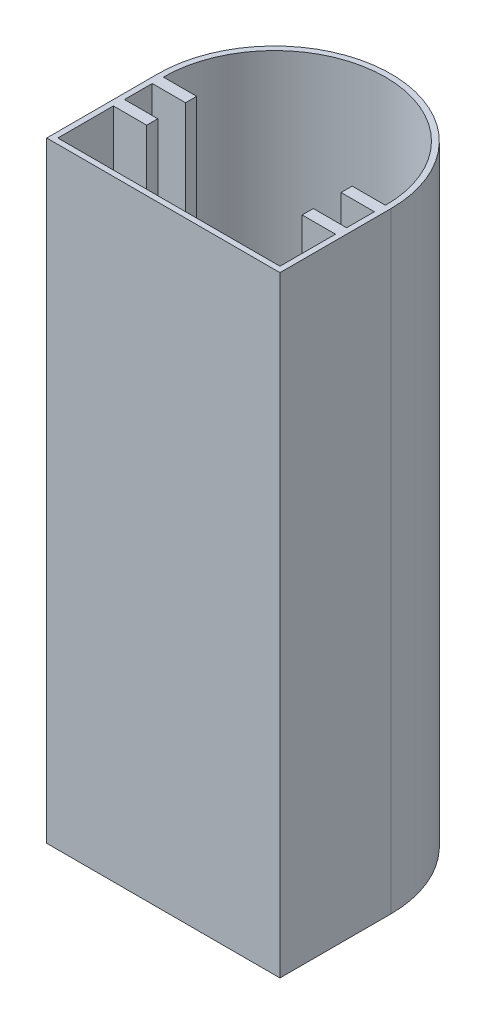
ISO-10303-21;
HEADER;
FILE_DESCRIPTION(('STEP AP214'),'2;1');
FILE_NAME('part.step','',(''),(''),'','','');
FILE_SCHEMA(('AUTOMOTIVE_DESIGN { 1 0 10303 214 1 1 1 1 }'));
ENDSEC;
DATA;
#1=APPLICATION_CONTEXT('core data for automotive mechanical design processes');
#2=APPLICATION_PROTOCOL_DEFINITION('international standard','automotive_design',2000,#1);
#3=PRODUCT_CONTEXT('',#1,'mechanical');
#4=PRODUCT('Part','Part','',(#3));
#5=PRODUCT_RELATED_PRODUCT_CATEGORY('part','',(#4));
#6=PRODUCT_DEFINITION_FORMATION('','',#4);
#7=PRODUCT_DEFINITION_CONTEXT('part definition',#1,'design');
#8=PRODUCT_DEFINITION('design','',#6,#7);
#9=PRODUCT_DEFINITION_SHAPE('','',#8);
#10=(LENGTH_UNIT() NAMED_UNIT(*) SI_UNIT(.MILLI.,.METRE.));
#11=(NAMED_UNIT(*) PLANE_ANGLE_UNIT() SI_UNIT($,.RADIAN.));
#12=(NAMED_UNIT(*) SI_UNIT($,.STERADIAN.) SOLID_ANGLE_UNIT());
#13=UNCERTAINTY_MEASURE_WITH_UNIT(LENGTH_MEASURE(1.E-05),#10,'distance_accuracy_value','');
#14=(GEOMETRIC_REPRESENTATION_CONTEXT(3) GLOBAL_UNCERTAINTY_ASSIGNED_CONTEXT((#13)) GLOBAL_UNIT_ASSIGNED_CONTEXT((#10,
#11,#12)) REPRESENTATION_CONTEXT('',''));
#15=CARTESIAN_POINT('',(0.,0.,0.));
#16=DIRECTION('',(0.,0.,1.));
#17=DIRECTION('',(1.,0.,0.));
#18=AXIS2_PLACEMENT_3D('',#15,#16,#17);
#19=CARTESIAN_POINT('',(-40.8830935251799,110.,1.70773381294964));
#20=DIRECTION('',(0.,0.,-1.));
#21=DIRECTION('',(-1.,0.,0.));
#22=AXIS2_PLACEMENT_3D('',#19,#20,#21);
#23=PLANE('',#22);
#24=DIRECTION('',(1.,0.,0.));
#25=VECTOR('',#24,1.);
#26=CARTESIAN_POINT('',(-40.8830935251799,0.,1.70773381294964));
#27=LINE('',#26,#25);
#28=CARTESIAN_POINT('',(-40.8830935251799,0.,1.70773381294964));
#29=VERTEX_POINT('',#28);
#30=CARTESIAN_POINT('',(1.11690647482014,0.,1.70773381294964));
#31=VERTEX_POINT('',#30);
#32=EDGE_CURVE('E311',#29,#31,#27,.T.);
#33=ORIENTED_EDGE('',*,*,#32,.T.);
#34=DIRECTION('',(0.,-1.,0.));
#35=VECTOR('',#34,1.);
#36=CARTESIAN_POINT('',(1.11690647482014,110.,1.70773381294964));
#37=LINE('',#36,#35);
#38=CARTESIAN_POINT('',(1.11690647482014,110.,1.70773381294964));
#39=VERTEX_POINT('',#38);
#40=EDGE_CURVE('E11',#39,#31,#37,.T.);
#41=ORIENTED_EDGE('',*,*,#40,.F.);
#42=DIRECTION('',(1.,0.,0.));
#43=VECTOR('',#42,1.);
#44=CARTESIAN_POINT('',(-40.8830935251799,110.,1.70773381294964));
#45=LINE('',#44,#43);
#46=CARTESIAN_POINT('',(-40.8830935251799,110.,1.70773381294964));
#47=VERTEX_POINT('',#46);
#48=EDGE_CURVE('E343',#47,#39,#45,.T.);
#49=ORIENTED_EDGE('',*,*,#48,.F.);
#50=DIRECTION('',(0.,-1.,0.));
#51=VECTOR('',#50,1.);
#52=CARTESIAN_POINT('',(-40.8830935251799,110.,1.70773381294964));
#53=LINE('',#52,#51);
#54=EDGE_CURVE('E57',#47,#29,#53,.T.);
#55=ORIENTED_EDGE('',*,*,#54,.T.);
#56=EDGE_LOOP('',(#33,#41,#49,#55));
#57=FACE_BOUND('',#56,.T.);
#58=ADVANCED_FACE('F33',(#57),#23,.F.);
#59=CARTESIAN_POINT('',(1.11690647482014,110.,1.70773381294964));
#60=DIRECTION('',(-1.,0.,0.));
#61=DIRECTION('',(0.,0.,1.));
#62=AXIS2_PLACEMENT_3D('',#59,#60,#61);
#63=PLANE('',#62);
#64=DIRECTION('',(0.,0.,-1.));
#65=VECTOR('',#64,1.);
#66=CARTESIAN_POINT('',(1.11690647482014,0.,1.70773381294964));
#67=LINE('',#66,#65);
#68=CARTESIAN_POINT('',(1.11690647482014,0.,-18.2922661870504));
#69=VERTEX_POINT('',#68);
#70=EDGE_CURVE('E352',#31,#69,#67,.T.);
#71=ORIENTED_EDGE('',*,*,#70,.T.);
#72=DIRECTION('',(0.,-1.,0.));
#73=VECTOR('',#72,1.);
#74=CARTESIAN_POINT('',(1.11690647482014,110.,-18.2922661870504));
#75=LINE('',#74,#73);
#76=CARTESIAN_POINT('',(1.11690647482014,110.,-18.2922661870504));
#77=VERTEX_POINT('',#76);
#78=EDGE_CURVE('E41',#77,#69,#75,.T.);
#79=ORIENTED_EDGE('',*,*,#78,.F.);
#80=DIRECTION('',(0.,0.,-1.));
#81=VECTOR('',#80,1.);
#82=CARTESIAN_POINT('',(1.11690647482014,110.,1.70773381294964));
#83=LINE('',#82,#81);
#84=EDGE_CURVE('E83',#39,#77,#83,.T.);
#85=ORIENTED_EDGE('',*,*,#84,.F.);
#86=ORIENTED_EDGE('',*,*,#40,.T.);
#87=EDGE_LOOP('',(#71,#79,#85,#86));
#88=FACE_BOUND('',#87,.T.);
#89=ADVANCED_FACE('F375',(#88),#63,.F.);
#90=CARTESIAN_POINT('',(-19.8830935251799,110.,-18.2922661870504));
#91=DIRECTION('',(0.,-1.,0.));
#92=DIRECTION('',(0.,0.,-1.));
#93=AXIS2_PLACEMENT_3D('',#90,#91,#92);
#94=CYLINDRICAL_SURFACE('',#93,21.);
#95=CARTESIAN_POINT('',(-19.8830935251799,0.,-18.2922661870504));
#96=DIRECTION('',(0.,1.,0.));
#97=DIRECTION('',(0.,0.,1.));
#98=AXIS2_PLACEMENT_3D('',#95,#96,#97);
#99=CIRCLE('',#98,21.);
#100=CARTESIAN_POINT('',(-40.8830935251799,0.,-18.2922661870504));
#101=VERTEX_POINT('',#100);
#102=EDGE_CURVE('E354',#69,#101,#99,.T.);
#103=ORIENTED_EDGE('',*,*,#102,.T.);
#104=DIRECTION('',(0.,-1.,0.));
#105=VECTOR('',#104,1.);
#106=CARTESIAN_POINT('',(-40.8830935251799,110.,-18.2922661870504));
#107=LINE('',#106,#105);
#108=CARTESIAN_POINT('',(-40.8830935251799,110.,-18.2922661870504));
#109=VERTEX_POINT('',#108);
#110=EDGE_CURVE('E360',#109,#101,#107,.T.);
#111=ORIENTED_EDGE('',*,*,#110,.F.);
#112=CARTESIAN_POINT('',(-19.8830935251799,110.,-18.2922661870504));
#113=DIRECTION('',(0.,1.,0.));
#114=DIRECTION('',(0.,0.,1.));
#115=AXIS2_PLACEMENT_3D('',#112,#113,#114);
#116=CIRCLE('',#115,21.);
#117=EDGE_CURVE('E347',#77,#109,#116,.T.);
#118=ORIENTED_EDGE('',*,*,#117,.F.);
#119=ORIENTED_EDGE('',*,*,#78,.T.);
#120=EDGE_LOOP('',(#103,#111,#118,#119));
#121=FACE_BOUND('',#120,.T.);
#122=ADVANCED_FACE('F366',(#121),#94,.T.);
#123=CARTESIAN_POINT('',(-40.8830935251799,110.,1.70773381294964));
#124=DIRECTION('',(-1.,0.,0.));
#125=DIRECTION('',(0.,0.,1.));
#126=AXIS2_PLACEMENT_3D('',#123,#124,#125);
#127=PLANE('',#126);
#128=CARTESIAN_POINT('',(-40.8830935251799,55.,-4.95893285371703));
#129=DIRECTION('',(-1.,0.,0.));
#130=DIRECTION('',(0.,0.,1.));
#131=AXIS2_PLACEMENT_3D('',#128,#129,#130);
#132=CIRCLE('',#131,3.375);
#133=CARTESIAN_POINT('',(-40.8830935251799,55.,-1.58393285371703));
#134=VERTEX_POINT('',#133);
#135=EDGE_CURVE('E217',#134,#134,#132,.T.);
#136=ORIENTED_EDGE('',*,*,#135,.F.);
#137=EDGE_LOOP('',(#136));
#138=FACE_BOUND('',#137,.T.);
#139=DIRECTION('',(0.,0.,-1.));
#140=VECTOR('',#139,1.);
#141=CARTESIAN_POINT('',(-40.8830935251799,0.,1.70773381294964));
#142=LINE('',#141,#140);
#143=EDGE_CURVE('E345',#29,#101,#142,.T.);
#144=ORIENTED_EDGE('',*,*,#143,.F.);
#145=ORIENTED_EDGE('',*,*,#54,.F.);
#146=DIRECTION('',(0.,0.,-1.));
#147=VECTOR('',#146,1.);
#148=CARTESIAN_POINT('',(-40.8830935251799,110.,1.70773381294964));
#149=LINE('',#148,#147);
#150=EDGE_CURVE('E349',#47,#109,#149,.T.);
#151=ORIENTED_EDGE('',*,*,#150,.T.);
#152=ORIENTED_EDGE('',*,*,#110,.T.);
#153=EDGE_LOOP('',(#144,#145,#151,#152));
#154=FACE_BOUND('',#153,.T.);
#155=ADVANCED_FACE('F370',(#138,#154),#127,.T.);
#156=CARTESIAN_POINT('',(-19.8830935251799,110.,-18.2922661870504));
#157=DIRECTION('',(0.,1.,0.));
#158=DIRECTION('',(0.,0.,1.));
#159=AXIS2_PLACEMENT_3D('',#156,#157,#158);
#160=PLANE('',#159);
#161=CARTESIAN_POINT('',(-19.8830935251799,110.,-18.2922661870504));
#162=DIRECTION('',(0.,1.,0.));
#163=DIRECTION('',(0.,0.,1.));
#164=AXIS2_PLACEMENT_3D('',#161,#162,#163);
#165=CIRCLE('',#164,20.);
#166=CARTESIAN_POINT('',(0.116906474820141,110.,-18.2922661870504));
#167=VERTEX_POINT('',#166);
#168=CARTESIAN_POINT('',(-39.8830935251799,110.,-18.2922661870504));
#169=VERTEX_POINT('',#168);
#170=EDGE_CURVE('E48',#167,#169,#165,.T.);
#171=ORIENTED_EDGE('',*,*,#170,.F.);
#172=DIRECTION('',(1.,0.,0.));
#173=VECTOR('',#172,1.);
#174=CARTESIAN_POINT('',(0.116906474820141,110.,-18.2922661870504));
#175=LINE('',#174,#173);
#176=CARTESIAN_POINT('',(-5.88309352517986,110.,-18.2922661870504));
#177=VERTEX_POINT('',#176);
#178=EDGE_CURVE('E211',#177,#167,#175,.T.);
#179=ORIENTED_EDGE('',*,*,#178,.F.);
#180=DIRECTION('',(0.,0.,-1.));
#181=VECTOR('',#180,1.);
#182=CARTESIAN_POINT('',(-5.88309352517986,110.,-18.2922661870504));
#183=LINE('',#182,#181);
#184=CARTESIAN_POINT('',(-5.88309352517985,110.,-16.2922661870504));
#185=VERTEX_POINT('',#184);
#186=EDGE_CURVE('E214',#185,#177,#183,.T.);
#187=ORIENTED_EDGE('',*,*,#186,.F.);
#188=DIRECTION('',(-1.,0.,0.));
#189=VECTOR('',#188,1.);
#190=CARTESIAN_POINT('',(-5.88309352517985,110.,-16.2922661870504));
#191=LINE('',#190,#189);
#192=CARTESIAN_POINT('',(0.116906474820142,110.,-16.2922661870504));
#193=VERTEX_POINT('',#192);
#194=EDGE_CURVE('E304',#193,#185,#191,.T.);
#195=ORIENTED_EDGE('',*,*,#194,.F.);
#196=DIRECTION('',(0.,0.,-1.));
#197=VECTOR('',#196,1.);
#198=CARTESIAN_POINT('',(0.116906474820142,110.,-16.2922661870504));
#199=LINE('',#198,#197);
#200=CARTESIAN_POINT('',(0.116906474820143,110.,-11.2922661870504));
#201=VERTEX_POINT('',#200);
#202=EDGE_CURVE('E301',#201,#193,#199,.T.);
#203=ORIENTED_EDGE('',*,*,#202,.F.);
#204=DIRECTION('',(1.,0.,0.));
#205=VECTOR('',#204,1.);
#206=CARTESIAN_POINT('',(0.116906474820143,110.,-11.2922661870504));
#207=LINE('',#206,#205);
#208=CARTESIAN_POINT('',(-5.88309352517986,110.,-11.2922661870504));
#209=VERTEX_POINT('',#208);
#210=EDGE_CURVE('E298',#209,#201,#207,.T.);
#211=ORIENTED_EDGE('',*,*,#210,.F.);
#212=DIRECTION('',(0.,0.,-1.));
#213=VECTOR('',#212,1.);
#214=CARTESIAN_POINT('',(-5.88309352517986,110.,-11.2922661870504));
#215=LINE('',#214,#213);
#216=CARTESIAN_POINT('',(-5.88309352517986,110.,-9.29226618705036));
#217=VERTEX_POINT('',#216);
#218=EDGE_CURVE('E295',#217,#209,#215,.T.);
#219=ORIENTED_EDGE('',*,*,#218,.F.);
#220=DIRECTION('',(-1.,0.,0.));
#221=VECTOR('',#220,1.);
#222=CARTESIAN_POINT('',(-5.88309352517986,110.,-9.29226618705036));
#223=LINE('',#222,#221);
#224=CARTESIAN_POINT('',(0.116906474820143,110.,-9.29226618705036));
#225=VERTEX_POINT('',#224);
#226=EDGE_CURVE('E292',#225,#217,#223,.T.);
#227=ORIENTED_EDGE('',*,*,#226,.F.);
#228=DIRECTION('',(0.,0.,-1.));
#229=VECTOR('',#228,1.);
#230=CARTESIAN_POINT('',(0.116906474820143,110.,-9.29226618705036));
#231=LINE('',#230,#229);
#232=CARTESIAN_POINT('',(0.116906474820145,110.,0.70773381294964));
#233=VERTEX_POINT('',#232);
#234=EDGE_CURVE('E289',#233,#225,#231,.T.);
#235=ORIENTED_EDGE('',*,*,#234,.F.);
#236=DIRECTION('',(1.,0.,0.));
#237=VECTOR('',#236,1.);
#238=CARTESIAN_POINT('',(-39.8830935251799,110.,0.707733812949641));
#239=LINE('',#238,#237);
#240=CARTESIAN_POINT('',(-39.8830935251799,110.,0.707733812949641));
#241=VERTEX_POINT('',#240);
#242=EDGE_CURVE('E286',#241,#233,#239,.T.);
#243=ORIENTED_EDGE('',*,*,#242,.F.);
#244=DIRECTION('',(0.,0.,1.));
#245=VECTOR('',#244,1.);
#246=CARTESIAN_POINT('',(-39.8830935251798,110.,-9.29226618705036));
#247=LINE('',#246,#245);
#248=CARTESIAN_POINT('',(-39.8830935251798,110.,-9.29226618705036));
#249=VERTEX_POINT('',#248);
#250=EDGE_CURVE('E283',#249,#241,#247,.T.);
#251=ORIENTED_EDGE('',*,*,#250,.F.);
#252=DIRECTION('',(-1.,0.,0.));
#253=VECTOR('',#252,1.);
#254=CARTESIAN_POINT('',(-33.8830935251798,110.,-9.29226618705036));
#255=LINE('',#254,#253);
#256=CARTESIAN_POINT('',(-33.8830935251798,110.,-9.29226618705036));
#257=VERTEX_POINT('',#256);
#258=EDGE_CURVE('E280',#257,#249,#255,.T.);
#259=ORIENTED_EDGE('',*,*,#258,.F.);
#260=DIRECTION('',(0.,0.,1.));
#261=VECTOR('',#260,1.);
#262=CARTESIAN_POINT('',(-33.8830935251798,110.,-11.2922661870504));
#263=LINE('',#262,#261);
#264=CARTESIAN_POINT('',(-33.8830935251798,110.,-11.2922661870504));
#265=VERTEX_POINT('',#264);
#266=EDGE_CURVE('E277',#265,#257,#263,.T.);
#267=ORIENTED_EDGE('',*,*,#266,.F.);
#268=DIRECTION('',(1.,0.,0.));
#269=VECTOR('',#268,1.);
#270=CARTESIAN_POINT('',(-39.8830935251798,110.,-11.2922661870504));
#271=LINE('',#270,#269);
#272=CARTESIAN_POINT('',(-39.8830935251798,110.,-11.2922661870504));
#273=VERTEX_POINT('',#272);
#274=EDGE_CURVE('E274',#273,#265,#271,.T.);
#275=ORIENTED_EDGE('',*,*,#274,.F.);
#276=DIRECTION('',(0.,0.,1.));
#277=VECTOR('',#276,1.);
#278=CARTESIAN_POINT('',(-39.8830935251798,110.,-16.2922661870504));
#279=LINE('',#278,#277);
#280=CARTESIAN_POINT('',(-39.8830935251798,110.,-16.2922661870504));
#281=VERTEX_POINT('',#280);
#282=EDGE_CURVE('E271',#281,#273,#279,.T.);
#283=ORIENTED_EDGE('',*,*,#282,.F.);
#284=DIRECTION('',(-1.,0.,0.));
#285=VECTOR('',#284,1.);
#286=CARTESIAN_POINT('',(-33.8830935251799,110.,-16.2922661870504));
#287=LINE('',#286,#285);
#288=CARTESIAN_POINT('',(-33.8830935251799,110.,-16.2922661870504));
#289=VERTEX_POINT('',#288);
#290=EDGE_CURVE('E268',#289,#281,#287,.T.);
#291=ORIENTED_EDGE('',*,*,#290,.F.);
#292=DIRECTION('',(0.,0.,1.));
#293=VECTOR('',#292,1.);
#294=CARTESIAN_POINT('',(-33.8830935251799,110.,-18.2922661870504));
#295=LINE('',#294,#293);
#296=CARTESIAN_POINT('',(-33.8830935251799,110.,-18.2922661870504));
#297=VERTEX_POINT('',#296);
#298=EDGE_CURVE('E265',#297,#289,#295,.T.);
#299=ORIENTED_EDGE('',*,*,#298,.F.);
#300=DIRECTION('',(1.,0.,0.));
#301=VECTOR('',#300,1.);
#302=CARTESIAN_POINT('',(-39.8830935251799,110.,-18.2922661870504));
#303=LINE('',#302,#301);
#304=EDGE_CURVE('E263',#169,#297,#303,.T.);
#305=ORIENTED_EDGE('',*,*,#304,.F.);
#306=EDGE_LOOP('',(#171,#179,#187,#195,#203,#211,#219,#227,#235,#243,#251,#259,#267,#275,#283,
#291,#299,#305));
#307=FACE_BOUND('',#306,.T.);
#308=ORIENTED_EDGE('',*,*,#48,.T.);
#309=ORIENTED_EDGE('',*,*,#84,.T.);
#310=ORIENTED_EDGE('',*,*,#117,.T.);
#311=ORIENTED_EDGE('',*,*,#150,.F.);
#312=EDGE_LOOP('',(#308,#309,#310,#311));
#313=FACE_BOUND('',#312,.T.);
#314=ADVANCED_FACE('F373',(#307,#313),#160,.T.);
#315=CARTESIAN_POINT('',(-19.8830935251799,0.,-18.2922661870504));
#316=DIRECTION('',(0.,1.,0.));
#317=DIRECTION('',(0.,0.,1.));
#318=AXIS2_PLACEMENT_3D('',#315,#316,#317);
#319=PLANE('',#318);
#320=ORIENTED_EDGE('',*,*,#32,.F.);
#321=ORIENTED_EDGE('',*,*,#143,.T.);
#322=ORIENTED_EDGE('',*,*,#102,.F.);
#323=ORIENTED_EDGE('',*,*,#70,.F.);
#324=EDGE_LOOP('',(#320,#321,#322,#323));
#325=FACE_BOUND('',#324,.T.);
#326=ADVANCED_FACE('F369',(#325),#319,.F.);
#327=CARTESIAN_POINT('',(-19.8830935251799,1.,-18.2922661870504));
#328=DIRECTION('',(0.,1.,0.));
#329=DIRECTION('',(0.,0.,1.));
#330=AXIS2_PLACEMENT_3D('',#327,#328,#329);
#331=CYLINDRICAL_SURFACE('',#330,20.);
#332=ORIENTED_EDGE('',*,*,#170,.T.);
#333=DIRECTION('',(0.,1.,0.));
#334=VECTOR('',#333,1.);
#335=CARTESIAN_POINT('',(-39.8830935251799,1.,-18.2922661870504));
#336=LINE('',#335,#334);
#337=CARTESIAN_POINT('',(-39.8830935251799,1.,-18.2922661870504));
#338=VERTEX_POINT('',#337);
#339=EDGE_CURVE('E188',#338,#169,#336,.T.);
#340=ORIENTED_EDGE('',*,*,#339,.F.);
#341=CARTESIAN_POINT('',(-19.8830935251799,1.,-18.2922661870504));
#342=DIRECTION('',(0.,1.,0.));
#343=DIRECTION('',(0.,0.,1.));
#344=AXIS2_PLACEMENT_3D('',#341,#342,#343);
#345=CIRCLE('',#344,20.);
#346=CARTESIAN_POINT('',(0.116906474820141,1.,-18.2922661870504));
#347=VERTEX_POINT('',#346);
#348=EDGE_CURVE('E192',#347,#338,#345,.T.);
#349=ORIENTED_EDGE('',*,*,#348,.F.);
#350=DIRECTION('',(0.,1.,0.));
#351=VECTOR('',#350,1.);
#352=CARTESIAN_POINT('',(0.116906474820141,1.,-18.2922661870504));
#353=LINE('',#352,#351);
#354=EDGE_CURVE('E309',#347,#167,#353,.T.);
#355=ORIENTED_EDGE('',*,*,#354,.T.);
#356=EDGE_LOOP('',(#332,#340,#349,#355));
#357=FACE_BOUND('',#356,.T.);
#358=ADVANCED_FACE('F190',(#357),#331,.F.);
#359=CARTESIAN_POINT('',(0.116906474820141,1.,-18.2922661870504));
#360=DIRECTION('',(0.,0.,1.));
#361=DIRECTION('',(1.,0.,0.));
#362=AXIS2_PLACEMENT_3D('',#359,#360,#361);
#363=PLANE('',#362);
#364=ORIENTED_EDGE('',*,*,#178,.T.);
#365=ORIENTED_EDGE('',*,*,#354,.F.);
#366=DIRECTION('',(1.,0.,0.));
#367=VECTOR('',#366,1.);
#368=CARTESIAN_POINT('',(0.116906474820141,1.,-18.2922661870504));
#369=LINE('',#368,#367);
#370=CARTESIAN_POINT('',(-5.88309352517986,1.,-18.2922661870504));
#371=VERTEX_POINT('',#370);
#372=EDGE_CURVE('E198',#371,#347,#369,.T.);
#373=ORIENTED_EDGE('',*,*,#372,.F.);
#374=DIRECTION('',(0.,1.,0.));
#375=VECTOR('',#374,1.);
#376=CARTESIAN_POINT('',(-5.88309352517986,1.,-18.2922661870504));
#377=LINE('',#376,#375);
#378=EDGE_CURVE('E312',#371,#177,#377,.T.);
#379=ORIENTED_EDGE('',*,*,#378,.T.);
#380=EDGE_LOOP('',(#364,#365,#373,#379));
#381=FACE_BOUND('',#380,.T.);
#382=ADVANCED_FACE('F393',(#381),#363,.F.);
#383=CARTESIAN_POINT('',(-5.88309352517986,1.,-18.2922661870504));
#384=DIRECTION('',(1.,0.,0.));
#385=DIRECTION('',(0.,0.,-1.));
#386=AXIS2_PLACEMENT_3D('',#383,#384,#385);
#387=PLANE('',#386);
#388=ORIENTED_EDGE('',*,*,#186,.T.);
#389=ORIENTED_EDGE('',*,*,#378,.F.);
#390=DIRECTION('',(0.,0.,-1.));
#391=VECTOR('',#390,1.);
#392=CARTESIAN_POINT('',(-5.88309352517986,1.,-18.2922661870504));
#393=LINE('',#392,#391);
#394=CARTESIAN_POINT('',(-5.88309352517985,1.,-16.2922661870504));
#395=VERTEX_POINT('',#394);
#396=EDGE_CURVE('E259',#395,#371,#393,.T.);
#397=ORIENTED_EDGE('',*,*,#396,.F.);
#398=DIRECTION('',(0.,1.,0.));
#399=VECTOR('',#398,1.);
#400=CARTESIAN_POINT('',(-5.88309352517985,1.,-16.2922661870504));
#401=LINE('',#400,#399);
#402=EDGE_CURVE('E314',#395,#185,#401,.T.);
#403=ORIENTED_EDGE('',*,*,#402,.T.);
#404=EDGE_LOOP('',(#388,#389,#397,#403));
#405=FACE_BOUND('',#404,.T.);
#406=ADVANCED_FACE('F451',(#405),#387,.F.);
#407=CARTESIAN_POINT('',(-5.88309352517985,1.,-16.2922661870504));
#408=DIRECTION('',(0.,0.,-1.));
#409=DIRECTION('',(-1.,0.,0.));
#410=AXIS2_PLACEMENT_3D('',#407,#408,#409);
#411=PLANE('',#410);
#412=ORIENTED_EDGE('',*,*,#194,.T.);
#413=ORIENTED_EDGE('',*,*,#402,.F.);
#414=DIRECTION('',(-1.,0.,0.));
#415=VECTOR('',#414,1.);
#416=CARTESIAN_POINT('',(-5.88309352517985,1.,-16.2922661870504));
#417=LINE('',#416,#415);
#418=CARTESIAN_POINT('',(0.116906474820142,1.,-16.2922661870504));
#419=VERTEX_POINT('',#418);
#420=EDGE_CURVE('E256',#419,#395,#417,.T.);
#421=ORIENTED_EDGE('',*,*,#420,.F.);
#422=DIRECTION('',(0.,1.,0.));
#423=VECTOR('',#422,1.);
#424=CARTESIAN_POINT('',(0.116906474820142,1.,-16.2922661870504));
#425=LINE('',#424,#423);
#426=EDGE_CURVE('E316',#419,#193,#425,.T.);
#427=ORIENTED_EDGE('',*,*,#426,.T.);
#428=EDGE_LOOP('',(#412,#413,#421,#427));
#429=FACE_BOUND('',#428,.T.);
#430=ADVANCED_FACE('F447',(#429),#411,.F.);
#431=CARTESIAN_POINT('',(0.116906474820142,1.,-16.2922661870504));
#432=DIRECTION('',(1.,0.,0.));
#433=DIRECTION('',(0.,0.,-1.));
#434=AXIS2_PLACEMENT_3D('',#431,#432,#433);
#435=PLANE('',#434);
#436=ORIENTED_EDGE('',*,*,#202,.T.);
#437=ORIENTED_EDGE('',*,*,#426,.F.);
#438=DIRECTION('',(0.,0.,-1.));
#439=VECTOR('',#438,1.);
#440=CARTESIAN_POINT('',(0.116906474820142,1.,-16.2922661870504));
#441=LINE('',#440,#439);
#442=CARTESIAN_POINT('',(0.116906474820143,1.,-11.2922661870504));
#443=VERTEX_POINT('',#442);
#444=EDGE_CURVE('E253',#443,#419,#441,.T.);
#445=ORIENTED_EDGE('',*,*,#444,.F.);
#446=DIRECTION('',(0.,1.,0.));
#447=VECTOR('',#446,1.);
#448=CARTESIAN_POINT('',(0.116906474820143,1.,-11.2922661870504));
#449=LINE('',#448,#447);
#450=EDGE_CURVE('E318',#443,#201,#449,.T.);
#451=ORIENTED_EDGE('',*,*,#450,.T.);
#452=EDGE_LOOP('',(#436,#437,#445,#451));
#453=FACE_BOUND('',#452,.T.);
#454=ADVANCED_FACE('F443',(#453),#435,.F.);
#455=CARTESIAN_POINT('',(0.116906474820143,1.,-11.2922661870504));
#456=DIRECTION('',(0.,0.,1.));
#457=DIRECTION('',(1.,0.,0.));
#458=AXIS2_PLACEMENT_3D('',#455,#456,#457);
#459=PLANE('',#458);
#460=ORIENTED_EDGE('',*,*,#210,.T.);
#461=ORIENTED_EDGE('',*,*,#450,.F.);
#462=DIRECTION('',(1.,0.,0.));
#463=VECTOR('',#462,1.);
#464=CARTESIAN_POINT('',(0.116906474820143,1.,-11.2922661870504));
#465=LINE('',#464,#463);
#466=CARTESIAN_POINT('',(-5.88309352517986,1.,-11.2922661870504));
#467=VERTEX_POINT('',#466);
#468=EDGE_CURVE('E250',#467,#443,#465,.T.);
#469=ORIENTED_EDGE('',*,*,#468,.F.);
#470=DIRECTION('',(0.,1.,0.));
#471=VECTOR('',#470,1.);
#472=CARTESIAN_POINT('',(-5.88309352517986,1.,-11.2922661870504));
#473=LINE('',#472,#471);
#474=EDGE_CURVE('E320',#467,#209,#473,.T.);
#475=ORIENTED_EDGE('',*,*,#474,.T.);
#476=EDGE_LOOP('',(#460,#461,#469,#475));
#477=FACE_BOUND('',#476,.T.);
#478=ADVANCED_FACE('F439',(#477),#459,.F.);
#479=CARTESIAN_POINT('',(-5.88309352517986,1.,-11.2922661870504));
#480=DIRECTION('',(1.,0.,0.));
#481=DIRECTION('',(0.,0.,-1.));
#482=AXIS2_PLACEMENT_3D('',#479,#480,#481);
#483=PLANE('',#482);
#484=ORIENTED_EDGE('',*,*,#218,.T.);
#485=ORIENTED_EDGE('',*,*,#474,.F.);
#486=DIRECTION('',(0.,0.,-1.));
#487=VECTOR('',#486,1.);
#488=CARTESIAN_POINT('',(-5.88309352517986,1.,-11.2922661870504));
#489=LINE('',#488,#487);
#490=CARTESIAN_POINT('',(-5.88309352517986,1.,-9.29226618705036));
#491=VERTEX_POINT('',#490);
#492=EDGE_CURVE('E247',#491,#467,#489,.T.);
#493=ORIENTED_EDGE('',*,*,#492,.F.);
#494=DIRECTION('',(0.,1.,0.));
#495=VECTOR('',#494,1.);
#496=CARTESIAN_POINT('',(-5.88309352517986,1.,-9.29226618705036));
#497=LINE('',#496,#495);
#498=EDGE_CURVE('E322',#491,#217,#497,.T.);
#499=ORIENTED_EDGE('',*,*,#498,.T.);
#500=EDGE_LOOP('',(#484,#485,#493,#499));
#501=FACE_BOUND('',#500,.T.);
#502=ADVANCED_FACE('F435',(#501),#483,.F.);
#503=CARTESIAN_POINT('',(-5.88309352517986,1.,-9.29226618705036));
#504=DIRECTION('',(0.,0.,-1.));
#505=DIRECTION('',(-1.,0.,0.));
#506=AXIS2_PLACEMENT_3D('',#503,#504,#505);
#507=PLANE('',#506);
#508=ORIENTED_EDGE('',*,*,#226,.T.);
#509=ORIENTED_EDGE('',*,*,#498,.F.);
#510=DIRECTION('',(-1.,0.,0.));
#511=VECTOR('',#510,1.);
#512=CARTESIAN_POINT('',(-5.88309352517986,1.,-9.29226618705036));
#513=LINE('',#512,#511);
#514=CARTESIAN_POINT('',(0.116906474820143,1.,-9.29226618705036));
#515=VERTEX_POINT('',#514);
#516=EDGE_CURVE('E244',#515,#491,#513,.T.);
#517=ORIENTED_EDGE('',*,*,#516,.F.);
#518=DIRECTION('',(0.,1.,0.));
#519=VECTOR('',#518,1.);
#520=CARTESIAN_POINT('',(0.116906474820143,1.,-9.29226618705036));
#521=LINE('',#520,#519);
#522=EDGE_CURVE('E324',#515,#225,#521,.T.);
#523=ORIENTED_EDGE('',*,*,#522,.T.);
#524=EDGE_LOOP('',(#508,#509,#517,#523));
#525=FACE_BOUND('',#524,.T.);
#526=ADVANCED_FACE('F431',(#525),#507,.F.);
#527=CARTESIAN_POINT('',(0.116906474820143,1.,-9.29226618705036));
#528=DIRECTION('',(1.,0.,0.));
#529=DIRECTION('',(0.,0.,-1.));
#530=AXIS2_PLACEMENT_3D('',#527,#528,#529);
#531=PLANE('',#530);
#532=ORIENTED_EDGE('',*,*,#234,.T.);
#533=ORIENTED_EDGE('',*,*,#522,.F.);
#534=DIRECTION('',(0.,0.,-1.));
#535=VECTOR('',#534,1.);
#536=CARTESIAN_POINT('',(0.116906474820143,1.,-9.29226618705036));
#537=LINE('',#536,#535);
#538=CARTESIAN_POINT('',(0.116906474820145,1.,0.70773381294964));
#539=VERTEX_POINT('',#538);
#540=EDGE_CURVE('E241',#539,#515,#537,.T.);
#541=ORIENTED_EDGE('',*,*,#540,.F.);
#542=DIRECTION('',(0.,1.,0.));
#543=VECTOR('',#542,1.);
#544=CARTESIAN_POINT('',(0.116906474820145,1.,0.70773381294964));
#545=LINE('',#544,#543);
#546=EDGE_CURVE('E326',#539,#233,#545,.T.);
#547=ORIENTED_EDGE('',*,*,#546,.T.);
#548=EDGE_LOOP('',(#532,#533,#541,#547));
#549=FACE_BOUND('',#548,.T.);
#550=ADVANCED_FACE('F427',(#549),#531,.F.);
#551=CARTESIAN_POINT('',(-39.8830935251799,1.,0.707733812949641));
#552=DIRECTION('',(0.,0.,1.));
#553=DIRECTION('',(1.,0.,0.));
#554=AXIS2_PLACEMENT_3D('',#551,#552,#553);
#555=PLANE('',#554);
#556=ORIENTED_EDGE('',*,*,#242,.T.);
#557=ORIENTED_EDGE('',*,*,#546,.F.);
#558=DIRECTION('',(1.,0.,0.));
#559=VECTOR('',#558,1.);
#560=CARTESIAN_POINT('',(-39.8830935251799,1.,0.707733812949641));
#561=LINE('',#560,#559);
#562=CARTESIAN_POINT('',(-39.8830935251799,1.,0.707733812949641));
#563=VERTEX_POINT('',#562);
#564=EDGE_CURVE('E238',#563,#539,#561,.T.);
#565=ORIENTED_EDGE('',*,*,#564,.F.);
#566=DIRECTION('',(0.,1.,0.));
#567=VECTOR('',#566,1.);
#568=CARTESIAN_POINT('',(-39.8830935251799,1.,0.707733812949641));
#569=LINE('',#568,#567);
#570=EDGE_CURVE('E328',#563,#241,#569,.T.);
#571=ORIENTED_EDGE('',*,*,#570,.T.);
#572=EDGE_LOOP('',(#556,#557,#565,#571));
#573=FACE_BOUND('',#572,.T.);
#574=ADVANCED_FACE('F423',(#573),#555,.F.);
#575=CARTESIAN_POINT('',(-39.8830935251798,1.,-9.29226618705036));
#576=DIRECTION('',(-1.,0.,0.));
#577=DIRECTION('',(0.,0.,1.));
#578=AXIS2_PLACEMENT_3D('',#575,#576,#577);
#579=PLANE('',#578);
#580=CARTESIAN_POINT('',(-39.8830935251799,55.,-4.95893285371703));
#581=DIRECTION('',(-1.,0.,0.));
#582=DIRECTION('',(0.,0.,1.));
#583=AXIS2_PLACEMENT_3D('',#580,#581,#582);
#584=CIRCLE('',#583,3.375);
#585=CARTESIAN_POINT('',(-39.8830935251799,55.,-1.58393285371703));
#586=VERTEX_POINT('',#585);
#587=EDGE_CURVE('E36',#586,#586,#584,.T.);
#588=ORIENTED_EDGE('',*,*,#587,.T.);
#589=EDGE_LOOP('',(#588));
#590=FACE_BOUND('',#589,.T.);
#591=ORIENTED_EDGE('',*,*,#250,.T.);
#592=ORIENTED_EDGE('',*,*,#570,.F.);
#593=DIRECTION('',(0.,0.,1.));
#594=VECTOR('',#593,1.);
#595=CARTESIAN_POINT('',(-39.8830935251798,1.,-9.29226618705036));
#596=LINE('',#595,#594);
#597=CARTESIAN_POINT('',(-39.8830935251798,1.,-9.29226618705036));
#598=VERTEX_POINT('',#597);
#599=EDGE_CURVE('E235',#598,#563,#596,.T.);
#600=ORIENTED_EDGE('',*,*,#599,.F.);
#601=DIRECTION('',(0.,1.,0.));
#602=VECTOR('',#601,1.);
#603=CARTESIAN_POINT('',(-39.8830935251798,1.,-9.29226618705036));
#604=LINE('',#603,#602);
#605=EDGE_CURVE('E330',#598,#249,#604,.T.);
#606=ORIENTED_EDGE('',*,*,#605,.T.);
#607=EDGE_LOOP('',(#591,#592,#600,#606));
#608=FACE_BOUND('',#607,.T.);
#609=ADVANCED_FACE('F419',(#590,#608),#579,.F.);
#610=CARTESIAN_POINT('',(-33.8830935251798,1.,-9.29226618705036));
#611=DIRECTION('',(0.,0.,-1.));
#612=DIRECTION('',(-1.,0.,0.));
#613=AXIS2_PLACEMENT_3D('',#610,#611,#612);
#614=PLANE('',#613);
#615=ORIENTED_EDGE('',*,*,#258,.T.);
#616=ORIENTED_EDGE('',*,*,#605,.F.);
#617=DIRECTION('',(-1.,0.,0.));
#618=VECTOR('',#617,1.);
#619=CARTESIAN_POINT('',(-33.8830935251798,1.,-9.29226618705036));
#620=LINE('',#619,#618);
#621=CARTESIAN_POINT('',(-33.8830935251798,1.,-9.29226618705036));
#622=VERTEX_POINT('',#621);
#623=EDGE_CURVE('E232',#622,#598,#620,.T.);
#624=ORIENTED_EDGE('',*,*,#623,.F.);
#625=DIRECTION('',(0.,1.,0.));
#626=VECTOR('',#625,1.);
#627=CARTESIAN_POINT('',(-33.8830935251798,1.,-9.29226618705036));
#628=LINE('',#627,#626);
#629=EDGE_CURVE('E332',#622,#257,#628,.T.);
#630=ORIENTED_EDGE('',*,*,#629,.T.);
#631=EDGE_LOOP('',(#615,#616,#624,#630));
#632=FACE_BOUND('',#631,.T.);
#633=ADVANCED_FACE('F415',(#632),#614,.F.);
#634=CARTESIAN_POINT('',(-33.8830935251798,1.,-11.2922661870504));
#635=DIRECTION('',(-1.,0.,0.));
#636=DIRECTION('',(0.,0.,1.));
#637=AXIS2_PLACEMENT_3D('',#634,#635,#636);
#638=PLANE('',#637);
#639=ORIENTED_EDGE('',*,*,#266,.T.);
#640=ORIENTED_EDGE('',*,*,#629,.F.);
#641=DIRECTION('',(0.,0.,1.));
#642=VECTOR('',#641,1.);
#643=CARTESIAN_POINT('',(-33.8830935251798,1.,-11.2922661870504));
#644=LINE('',#643,#642);
#645=CARTESIAN_POINT('',(-33.8830935251798,1.,-11.2922661870504));
#646=VERTEX_POINT('',#645);
#647=EDGE_CURVE('E229',#646,#622,#644,.T.);
#648=ORIENTED_EDGE('',*,*,#647,.F.);
#649=DIRECTION('',(0.,1.,0.));
#650=VECTOR('',#649,1.);
#651=CARTESIAN_POINT('',(-33.8830935251798,1.,-11.2922661870504));
#652=LINE('',#651,#650);
#653=EDGE_CURVE('E334',#646,#265,#652,.T.);
#654=ORIENTED_EDGE('',*,*,#653,.T.);
#655=EDGE_LOOP('',(#639,#640,#648,#654));
#656=FACE_BOUND('',#655,.T.);
#657=ADVANCED_FACE('F411',(#656),#638,.F.);
#658=CARTESIAN_POINT('',(-39.8830935251798,1.,-11.2922661870504));
#659=DIRECTION('',(0.,0.,1.));
#660=DIRECTION('',(1.,0.,0.));
#661=AXIS2_PLACEMENT_3D('',#658,#659,#660);
#662=PLANE('',#661);
#663=ORIENTED_EDGE('',*,*,#274,.T.);
#664=ORIENTED_EDGE('',*,*,#653,.F.);
#665=DIRECTION('',(1.,0.,0.));
#666=VECTOR('',#665,1.);
#667=CARTESIAN_POINT('',(-39.8830935251798,1.,-11.2922661870504));
#668=LINE('',#667,#666);
#669=CARTESIAN_POINT('',(-39.8830935251798,1.,-11.2922661870504));
#670=VERTEX_POINT('',#669);
#671=EDGE_CURVE('E226',#670,#646,#668,.T.);
#672=ORIENTED_EDGE('',*,*,#671,.F.);
#673=DIRECTION('',(0.,1.,0.));
#674=VECTOR('',#673,1.);
#675=CARTESIAN_POINT('',(-39.8830935251798,1.,-11.2922661870504));
#676=LINE('',#675,#674);
#677=EDGE_CURVE('E336',#670,#273,#676,.T.);
#678=ORIENTED_EDGE('',*,*,#677,.T.);
#679=EDGE_LOOP('',(#663,#664,#672,#678));
#680=FACE_BOUND('',#679,.T.);
#681=ADVANCED_FACE('F407',(#680),#662,.F.);
#682=CARTESIAN_POINT('',(-39.8830935251798,1.,-16.2922661870504));
#683=DIRECTION('',(-1.,0.,0.));
#684=DIRECTION('',(0.,0.,1.));
#685=AXIS2_PLACEMENT_3D('',#682,#683,#684);
#686=PLANE('',#685);
#687=ORIENTED_EDGE('',*,*,#282,.T.);
#688=ORIENTED_EDGE('',*,*,#677,.F.);
#689=DIRECTION('',(0.,0.,1.));
#690=VECTOR('',#689,1.);
#691=CARTESIAN_POINT('',(-39.8830935251798,1.,-16.2922661870504));
#692=LINE('',#691,#690);
#693=CARTESIAN_POINT('',(-39.8830935251798,1.,-16.2922661870504));
#694=VERTEX_POINT('',#693);
#695=EDGE_CURVE('E223',#694,#670,#692,.T.);
#696=ORIENTED_EDGE('',*,*,#695,.F.);
#697=DIRECTION('',(0.,1.,0.));
#698=VECTOR('',#697,1.);
#699=CARTESIAN_POINT('',(-39.8830935251798,1.,-16.2922661870504));
#700=LINE('',#699,#698);
#701=EDGE_CURVE('E338',#694,#281,#700,.T.);
#702=ORIENTED_EDGE('',*,*,#701,.T.);
#703=EDGE_LOOP('',(#687,#688,#696,#702));
#704=FACE_BOUND('',#703,.T.);
#705=ADVANCED_FACE('F403',(#704),#686,.F.);
#706=CARTESIAN_POINT('',(-33.8830935251799,1.,-16.2922661870504));
#707=DIRECTION('',(0.,0.,-1.));
#708=DIRECTION('',(-1.,0.,0.));
#709=AXIS2_PLACEMENT_3D('',#706,#707,#708);
#710=PLANE('',#709);
#711=ORIENTED_EDGE('',*,*,#290,.T.);
#712=ORIENTED_EDGE('',*,*,#701,.F.);
#713=DIRECTION('',(-1.,0.,0.));
#714=VECTOR('',#713,1.);
#715=CARTESIAN_POINT('',(-33.8830935251799,1.,-16.2922661870504));
#716=LINE('',#715,#714);
#717=CARTESIAN_POINT('',(-33.8830935251799,1.,-16.2922661870504));
#718=VERTEX_POINT('',#717);
#719=EDGE_CURVE('E220',#718,#694,#716,.T.);
#720=ORIENTED_EDGE('',*,*,#719,.F.);
#721=DIRECTION('',(0.,1.,0.));
#722=VECTOR('',#721,1.);
#723=CARTESIAN_POINT('',(-33.8830935251799,1.,-16.2922661870504));
#724=LINE('',#723,#722);
#725=EDGE_CURVE('E340',#718,#289,#724,.T.);
#726=ORIENTED_EDGE('',*,*,#725,.T.);
#727=EDGE_LOOP('',(#711,#712,#720,#726));
#728=FACE_BOUND('',#727,.T.);
#729=ADVANCED_FACE('F399',(#728),#710,.F.);
#730=CARTESIAN_POINT('',(-33.8830935251799,1.,-18.2922661870504));
#731=DIRECTION('',(-1.,0.,0.));
#732=DIRECTION('',(0.,0.,1.));
#733=AXIS2_PLACEMENT_3D('',#730,#731,#732);
#734=PLANE('',#733);
#735=ORIENTED_EDGE('',*,*,#298,.T.);
#736=ORIENTED_EDGE('',*,*,#725,.F.);
#737=DIRECTION('',(0.,0.,1.));
#738=VECTOR('',#737,1.);
#739=CARTESIAN_POINT('',(-33.8830935251799,1.,-18.2922661870504));
#740=LINE('',#739,#738);
#741=CARTESIAN_POINT('',(-33.8830935251799,1.,-18.2922661870504));
#742=VERTEX_POINT('',#741);
#743=EDGE_CURVE('E206',#742,#718,#740,.T.);
#744=ORIENTED_EDGE('',*,*,#743,.F.);
#745=DIRECTION('',(0.,1.,0.));
#746=VECTOR('',#745,1.);
#747=CARTESIAN_POINT('',(-33.8830935251799,1.,-18.2922661870504));
#748=LINE('',#747,#746);
#749=EDGE_CURVE('E197',#742,#297,#748,.T.);
#750=ORIENTED_EDGE('',*,*,#749,.T.);
#751=EDGE_LOOP('',(#735,#736,#744,#750));
#752=FACE_BOUND('',#751,.T.);
#753=ADVANCED_FACE('F396',(#752),#734,.F.);
#754=CARTESIAN_POINT('',(-39.8830935251799,1.,-18.2922661870504));
#755=DIRECTION('',(0.,0.,1.));
#756=DIRECTION('',(1.,0.,0.));
#757=AXIS2_PLACEMENT_3D('',#754,#755,#756);
#758=PLANE('',#757);
#759=ORIENTED_EDGE('',*,*,#304,.T.);
#760=ORIENTED_EDGE('',*,*,#749,.F.);
#761=DIRECTION('',(1.,0.,0.));
#762=VECTOR('',#761,1.);
#763=CARTESIAN_POINT('',(-39.8830935251799,1.,-18.2922661870504));
#764=LINE('',#763,#762);
#765=EDGE_CURVE('E201',#338,#742,#764,.T.);
#766=ORIENTED_EDGE('',*,*,#765,.F.);
#767=ORIENTED_EDGE('',*,*,#339,.T.);
#768=EDGE_LOOP('',(#759,#760,#766,#767));
#769=FACE_BOUND('',#768,.T.);
#770=ADVANCED_FACE('F202',(#769),#758,.F.);
#771=CARTESIAN_POINT('',(-19.8830935251799,1.,-18.2922661870504));
#772=DIRECTION('',(0.,1.,0.));
#773=DIRECTION('',(0.,0.,1.));
#774=AXIS2_PLACEMENT_3D('',#771,#772,#773);
#775=PLANE('',#774);
#776=ORIENTED_EDGE('',*,*,#348,.T.);
#777=ORIENTED_EDGE('',*,*,#765,.T.);
#778=ORIENTED_EDGE('',*,*,#743,.T.);
#779=ORIENTED_EDGE('',*,*,#719,.T.);
#780=ORIENTED_EDGE('',*,*,#695,.T.);
#781=ORIENTED_EDGE('',*,*,#671,.T.);
#782=ORIENTED_EDGE('',*,*,#647,.T.);
#783=ORIENTED_EDGE('',*,*,#623,.T.);
#784=ORIENTED_EDGE('',*,*,#599,.T.);
#785=ORIENTED_EDGE('',*,*,#564,.T.);
#786=ORIENTED_EDGE('',*,*,#540,.T.);
#787=ORIENTED_EDGE('',*,*,#516,.T.);
#788=ORIENTED_EDGE('',*,*,#492,.T.);
#789=ORIENTED_EDGE('',*,*,#468,.T.);
#790=ORIENTED_EDGE('',*,*,#444,.T.);
#791=ORIENTED_EDGE('',*,*,#420,.T.);
#792=ORIENTED_EDGE('',*,*,#396,.T.);
#793=ORIENTED_EDGE('',*,*,#372,.T.);
#794=EDGE_LOOP('',(#776,#777,#778,#779,#780,#781,#782,#783,#784,#785,#786,#787,#788,#789,#790,
#791,#792,#793));
#795=FACE_BOUND('',#794,.T.);
#796=ADVANCED_FACE('F208',(#795),#775,.T.);
#797=CARTESIAN_POINT('',(-35.8830935251799,55.,-4.95893285371703));
#798=DIRECTION('',(-1.,0.,0.));
#799=DIRECTION('',(0.,0.,1.));
#800=AXIS2_PLACEMENT_3D('',#797,#798,#799);
#801=CYLINDRICAL_SURFACE('',#800,3.375);
#802=ORIENTED_EDGE('',*,*,#135,.T.);
#803=EDGE_LOOP('',(#802));
#804=FACE_BOUND('',#803,.T.);
#805=ORIENTED_EDGE('',*,*,#587,.F.);
#806=EDGE_LOOP('',(#805));
#807=FACE_BOUND('',#806,.T.);
#808=ADVANCED_FACE('F461',(#804,#807),#801,.F.);
#809=CLOSED_SHELL('',(#58,#89,#122,#155,#314,#326,#358,#382,#406,#430,#454,#478,#502,#526,#550,
#574,#609,#633,#657,#681,#705,#729,#753,#770,#796,#808));
#810=MANIFOLD_SOLID_BREP('B2',#809);
#811=ADVANCED_BREP_SHAPE_REPRESENTATION('',(#18,#810),#14);
#812=SHAPE_DEFINITION_REPRESENTATION(#9,#811);
ENDSEC;
END-ISO-10303-21;
